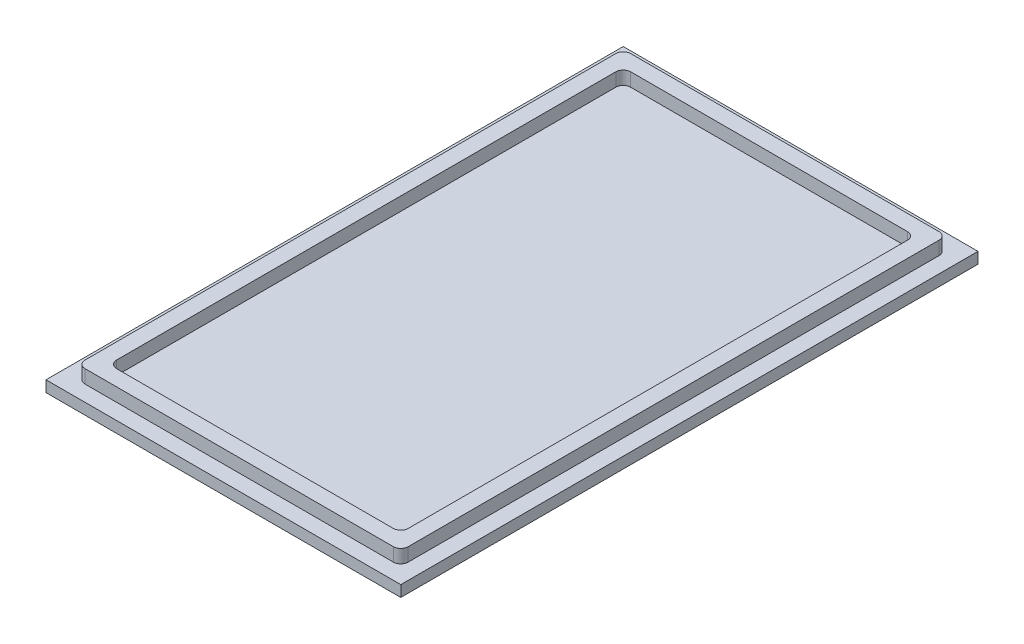
ISO-10303-21;
HEADER;
FILE_DESCRIPTION(('STEP AP214'),'2;1');
FILE_NAME('part.step','',(''),(''),'','','');
FILE_SCHEMA(('AUTOMOTIVE_DESIGN { 1 0 10303 214 1 1 1 1 }'));
ENDSEC;
DATA;
#1=APPLICATION_CONTEXT('core data for automotive mechanical design processes');
#2=APPLICATION_PROTOCOL_DEFINITION('international standard','automotive_design',2000,#1);
#3=PRODUCT_CONTEXT('',#1,'mechanical');
#4=PRODUCT('Part','Part','',(#3));
#5=PRODUCT_RELATED_PRODUCT_CATEGORY('part','',(#4));
#6=PRODUCT_DEFINITION_FORMATION('','',#4);
#7=PRODUCT_DEFINITION_CONTEXT('part definition',#1,'design');
#8=PRODUCT_DEFINITION('design','',#6,#7);
#9=PRODUCT_DEFINITION_SHAPE('','',#8);
#10=(LENGTH_UNIT() NAMED_UNIT(*) SI_UNIT(.MILLI.,.METRE.));
#11=(NAMED_UNIT(*) PLANE_ANGLE_UNIT() SI_UNIT($,.RADIAN.));
#12=(NAMED_UNIT(*) SI_UNIT($,.STERADIAN.) SOLID_ANGLE_UNIT());
#13=UNCERTAINTY_MEASURE_WITH_UNIT(LENGTH_MEASURE(1.E-05),#10,'distance_accuracy_value','');
#14=(GEOMETRIC_REPRESENTATION_CONTEXT(3) GLOBAL_UNCERTAINTY_ASSIGNED_CONTEXT((#13)) GLOBAL_UNIT_ASSIGNED_CONTEXT((#10,
#11,#12)) REPRESENTATION_CONTEXT('',''));
#15=CARTESIAN_POINT('',(0.,0.,0.));
#16=DIRECTION('',(0.,0.,1.));
#17=DIRECTION('',(1.,0.,0.));
#18=AXIS2_PLACEMENT_3D('',#15,#16,#17);
#19=CARTESIAN_POINT('',(0.203228322161903,-0.0321835084893109,0.352643796766574));
#20=DIRECTION('',(0.,1.,0.));
#21=DIRECTION('',(0.,0.,1.));
#22=AXIS2_PLACEMENT_3D('',#19,#20,#21);
#23=PLANE('',#22);
#24=DIRECTION('',(0.,0.,-1.));
#25=VECTOR('',#24,1.);
#26=CARTESIAN_POINT('',(32.2028322161904,-0.0321835084893109,0.352643796766574));
#27=LINE('',#26,#25);
#28=CARTESIAN_POINT('',(32.2028322161904,-0.0321835084893109,66.9298850382692));
#29=VERTEX_POINT('',#28);
#30=CARTESIAN_POINT('',(32.2028322161904,-0.0321835084893105,59.0098850382692));
#31=VERTEX_POINT('',#30);
#32=EDGE_CURVE('E310',#29,#31,#27,.T.);
#33=ORIENTED_EDGE('',*,*,#32,.T.);
#34=DIRECTION('',(1.,0.,0.));
#35=VECTOR('',#34,1.);
#36=CARTESIAN_POINT('',(8.44283221619036,-0.0321835084893105,59.0098850382692));
#37=LINE('',#36,#35);
#38=CARTESIAN_POINT('',(8.44283221619036,-0.0321835084893105,59.0098850382692));
#39=VERTEX_POINT('',#38);
#40=EDGE_CURVE('E297',#39,#31,#37,.T.);
#41=ORIENTED_EDGE('',*,*,#40,.F.);
#42=DIRECTION('',(0.,0.,-1.));
#43=VECTOR('',#42,1.);
#44=CARTESIAN_POINT('',(8.44283221619036,-0.0321835084893109,0.352643796766575));
#45=LINE('',#44,#43);
#46=CARTESIAN_POINT('',(8.44283221619035,-0.0321835084893109,66.9298850382692));
#47=VERTEX_POINT('',#46);
#48=EDGE_CURVE('E302',#47,#39,#45,.T.);
#49=ORIENTED_EDGE('',*,*,#48,.F.);
#50=DIRECTION('',(1.,0.,0.));
#51=VECTOR('',#50,1.);
#52=CARTESIAN_POINT('',(0.203228322161903,-0.0321835084893109,66.9298850382692));
#53=LINE('',#52,#51);
#54=EDGE_CURVE('E303',#47,#29,#53,.T.);
#55=ORIENTED_EDGE('',*,*,#54,.T.);
#56=EDGE_LOOP('',(#33,#41,#49,#55));
#57=FACE_BOUND('',#56,.T.);
#58=DIRECTION('',(0.,0.,-1.));
#59=VECTOR('',#58,1.);
#60=CARTESIAN_POINT('',(43.9426146770922,-0.0321835084893109,73.7128301516969));
#61=LINE('',#60,#59);
#62=CARTESIAN_POINT('',(43.9426146770922,-0.0321835084893109,73.7128301516969));
#63=VERTEX_POINT('',#62);
#64=CARTESIAN_POINT('',(43.9426146770922,-0.0321835084893109,-3.14753477010683));
#65=VERTEX_POINT('',#64);
#66=EDGE_CURVE('E377',#63,#65,#61,.T.);
#67=ORIENTED_EDGE('',*,*,#66,.F.);
#68=DIRECTION('',(-1.,0.,0.));
#69=VECTOR('',#68,1.);
#70=CARTESIAN_POINT('',(43.9426146770922,-0.0321835084893109,73.7128301516969));
#71=LINE('',#70,#69);
#72=CARTESIAN_POINT('',(-3.29695024471152,-0.0321835084893109,73.7128301516969));
#73=VERTEX_POINT('',#72);
#74=EDGE_CURVE('E397',#63,#73,#71,.T.);
#75=ORIENTED_EDGE('',*,*,#74,.T.);
#76=DIRECTION('',(0.,0.,-1.));
#77=VECTOR('',#76,1.);
#78=CARTESIAN_POINT('',(-3.29695024471152,-0.0321835084893109,73.7128301516969));
#79=LINE('',#78,#77);
#80=CARTESIAN_POINT('',(-3.29695024471152,-0.0321835084893109,-3.14753477010683));
#81=VERTEX_POINT('',#80);
#82=EDGE_CURVE('E416',#73,#81,#79,.T.);
#83=ORIENTED_EDGE('',*,*,#82,.T.);
#84=DIRECTION('',(-1.,0.,0.));
#85=VECTOR('',#84,1.);
#86=CARTESIAN_POINT('',(43.9426146770922,-0.0321835084893109,-3.14753477010683));
#87=LINE('',#86,#85);
#88=EDGE_CURVE('E412',#65,#81,#87,.T.);
#89=ORIENTED_EDGE('',*,*,#88,.F.);
#90=EDGE_LOOP('',(#67,#75,#83,#89));
#91=FACE_BOUND('',#90,.T.);
#92=DIRECTION('',(1.,0.,0.));
#93=VECTOR('',#92,1.);
#94=CARTESIAN_POINT('',(0.203228322161903,-0.0321835084893109,3.56988503826919));
#95=LINE('',#94,#93);
#96=CARTESIAN_POINT('',(8.44283221619036,-0.0321835084893109,3.56988503826919));
#97=VERTEX_POINT('',#96);
#98=CARTESIAN_POINT('',(32.2028322161904,-0.0321835084893109,3.56988503826919));
#99=VERTEX_POINT('',#98);
#100=EDGE_CURVE('E300',#97,#99,#95,.T.);
#101=ORIENTED_EDGE('',*,*,#100,.F.);
#102=CARTESIAN_POINT('',(8.44283221619036,-0.0321835084893113,11.4898850382692));
#103=VERTEX_POINT('',#102);
#104=EDGE_CURVE('E277',#103,#97,#45,.T.);
#105=ORIENTED_EDGE('',*,*,#104,.F.);
#106=DIRECTION('',(1.,0.,0.));
#107=VECTOR('',#106,1.);
#108=CARTESIAN_POINT('',(8.44283221619036,-0.0321835084893113,11.4898850382692));
#109=LINE('',#108,#107);
#110=CARTESIAN_POINT('',(32.2028322161904,-0.0321835084893113,11.4898850382692));
#111=VERTEX_POINT('',#110);
#112=EDGE_CURVE('E286',#103,#111,#109,.T.);
#113=ORIENTED_EDGE('',*,*,#112,.T.);
#114=EDGE_CURVE('E592',#111,#99,#27,.T.);
#115=ORIENTED_EDGE('',*,*,#114,.T.);
#116=EDGE_LOOP('',(#101,#105,#113,#115));
#117=FACE_BOUND('',#116,.T.);
#118=ADVANCED_FACE('F62',(#57,#91,#117),#23,.F.);
#119=CARTESIAN_POINT('',(0.203228322161903,1.45281649151069,0.352643796766574));
#120=DIRECTION('',(0.,1.,0.));
#121=DIRECTION('',(0.,0.,1.));
#122=AXIS2_PLACEMENT_3D('',#119,#120,#121);
#123=PLANE('',#122);
#124=DIRECTION('',(0.,0.,-1.));
#125=VECTOR('',#124,1.);
#126=CARTESIAN_POINT('',(43.9426146770922,1.45281649151069,73.7128301516969));
#127=LINE('',#126,#125);
#128=CARTESIAN_POINT('',(43.9426146770922,1.45281649151069,73.7128301516969));
#129=VERTEX_POINT('',#128);
#130=CARTESIAN_POINT('',(43.9426146770922,1.45281649151069,-3.14753477010683));
#131=VERTEX_POINT('',#130);
#132=EDGE_CURVE('E392',#129,#131,#127,.T.);
#133=ORIENTED_EDGE('',*,*,#132,.T.);
#134=DIRECTION('',(-1.,0.,0.));
#135=VECTOR('',#134,1.);
#136=CARTESIAN_POINT('',(43.9426146770922,1.45281649151069,-3.14753477010683));
#137=LINE('',#136,#135);
#138=CARTESIAN_POINT('',(-3.29695024471152,1.45281649151069,-3.14753477010683));
#139=VERTEX_POINT('',#138);
#140=EDGE_CURVE('E396',#131,#139,#137,.T.);
#141=ORIENTED_EDGE('',*,*,#140,.T.);
#142=DIRECTION('',(0.,0.,-1.));
#143=VECTOR('',#142,1.);
#144=CARTESIAN_POINT('',(-3.29695024471152,1.45281649151069,73.7128301516969));
#145=LINE('',#144,#143);
#146=CARTESIAN_POINT('',(-3.29695024471152,1.45281649151069,73.7128301516969));
#147=VERTEX_POINT('',#146);
#148=EDGE_CURVE('E400',#147,#139,#145,.T.);
#149=ORIENTED_EDGE('',*,*,#148,.F.);
#150=DIRECTION('',(-1.,0.,0.));
#151=VECTOR('',#150,1.);
#152=CARTESIAN_POINT('',(43.9426146770922,1.45281649151069,73.7128301516969));
#153=LINE('',#152,#151);
#154=EDGE_CURVE('E404',#129,#147,#153,.T.);
#155=ORIENTED_EDGE('',*,*,#154,.F.);
#156=EDGE_LOOP('',(#133,#141,#149,#155));
#157=FACE_BOUND('',#156,.T.);
#158=DIRECTION('',(1.,0.,0.));
#159=VECTOR('',#158,1.);
#160=CARTESIAN_POINT('',(-1.19684310458746,1.45281649151069,71.6127230115728));
#161=LINE('',#160,#159);
#162=CARTESIAN_POINT('',(-0.206843104587465,1.45281649151069,71.6127230115728));
#163=VERTEX_POINT('',#162);
#164=CARTESIAN_POINT('',(40.8525075369682,1.45281649151069,71.6127230115728));
#165=VERTEX_POINT('',#164);
#166=EDGE_CURVE('E381',#163,#165,#161,.T.);
#167=ORIENTED_EDGE('',*,*,#166,.F.);
#168=CARTESIAN_POINT('',(-0.206843104587465,1.45281649151069,70.6227230115728));
#169=DIRECTION('',(0.,1.,0.));
#170=DIRECTION('',(0.,0.,1.));
#171=AXIS2_PLACEMENT_3D('',#168,#169,#170);
#172=CIRCLE('',#171,0.99);
#173=CARTESIAN_POINT('',(-1.19684310458746,1.45281649151069,70.6227230115728));
#174=VERTEX_POINT('',#173);
#175=EDGE_CURVE('E518',#163,#174,#172,.F.);
#176=ORIENTED_EDGE('',*,*,#175,.T.);
#177=DIRECTION('',(0.,0.,1.));
#178=VECTOR('',#177,1.);
#179=CARTESIAN_POINT('',(-1.19684310458747,1.45281649151069,-1.04742762998278));
#180=LINE('',#179,#178);
#181=CARTESIAN_POINT('',(-1.19684310458747,1.45281649151069,-0.0574276299827787));
#182=VERTEX_POINT('',#181);
#183=EDGE_CURVE('E345',#182,#174,#180,.T.);
#184=ORIENTED_EDGE('',*,*,#183,.F.);
#185=CARTESIAN_POINT('',(-0.206843104587473,1.45281649151069,-0.0574276299827787));
#186=DIRECTION('',(0.,1.,0.));
#187=DIRECTION('',(0.,0.,1.));
#188=AXIS2_PLACEMENT_3D('',#185,#186,#187);
#189=CIRCLE('',#188,0.99);
#190=CARTESIAN_POINT('',(-0.206843104587473,1.45281649151069,-1.04742762998278));
#191=VERTEX_POINT('',#190);
#192=EDGE_CURVE('E536',#182,#191,#189,.F.);
#193=ORIENTED_EDGE('',*,*,#192,.T.);
#194=DIRECTION('',(1.,0.,0.));
#195=VECTOR('',#194,1.);
#196=CARTESIAN_POINT('',(-1.19684310458747,1.45281649151069,-1.04742762998278));
#197=LINE('',#196,#195);
#198=CARTESIAN_POINT('',(40.8525075369682,1.45281649151069,-1.04742762998278));
#199=VERTEX_POINT('',#198);
#200=EDGE_CURVE('E365',#191,#199,#197,.T.);
#201=ORIENTED_EDGE('',*,*,#200,.T.);
#202=CARTESIAN_POINT('',(40.8525075369682,1.45281649151069,-0.0574276299827787));
#203=DIRECTION('',(0.,1.,0.));
#204=DIRECTION('',(0.,0.,1.));
#205=AXIS2_PLACEMENT_3D('',#202,#203,#204);
#206=CIRCLE('',#205,0.99);
#207=CARTESIAN_POINT('',(41.8425075369682,1.45281649151069,-0.0574276299827789));
#208=VERTEX_POINT('',#207);
#209=EDGE_CURVE('E533',#199,#208,#206,.F.);
#210=ORIENTED_EDGE('',*,*,#209,.T.);
#211=DIRECTION('',(0.,0.,1.));
#212=VECTOR('',#211,1.);
#213=CARTESIAN_POINT('',(41.8425075369682,1.45281649151069,-1.04742762998278));
#214=LINE('',#213,#212);
#215=CARTESIAN_POINT('',(41.8425075369682,1.45281649151069,70.6227230115728));
#216=VERTEX_POINT('',#215);
#217=EDGE_CURVE('E385',#208,#216,#214,.T.);
#218=ORIENTED_EDGE('',*,*,#217,.T.);
#219=CARTESIAN_POINT('',(40.8525075369682,1.45281649151069,70.6227230115728));
#220=DIRECTION('',(0.,1.,0.));
#221=DIRECTION('',(0.,0.,1.));
#222=AXIS2_PLACEMENT_3D('',#219,#220,#221);
#223=CIRCLE('',#222,0.99);
#224=EDGE_CURVE('E524',#216,#165,#223,.F.);
#225=ORIENTED_EDGE('',*,*,#224,.T.);
#226=EDGE_LOOP('',(#167,#176,#184,#193,#201,#210,#218,#225));
#227=FACE_BOUND('',#226,.T.);
#228=ADVANCED_FACE('F653',(#157,#227),#123,.T.);
#229=CARTESIAN_POINT('',(43.9426146770922,1.45281649151069,73.7128301516969));
#230=DIRECTION('',(-1.,0.,0.));
#231=DIRECTION('',(0.,0.,1.));
#232=AXIS2_PLACEMENT_3D('',#229,#230,#231);
#233=PLANE('',#232);
#234=ORIENTED_EDGE('',*,*,#66,.T.);
#235=DIRECTION('',(0.,-1.,0.));
#236=VECTOR('',#235,1.);
#237=CARTESIAN_POINT('',(43.9426146770922,1.45281649151069,-3.14753477010683));
#238=LINE('',#237,#236);
#239=EDGE_CURVE('E431',#131,#65,#238,.T.);
#240=ORIENTED_EDGE('',*,*,#239,.F.);
#241=ORIENTED_EDGE('',*,*,#132,.F.);
#242=DIRECTION('',(0.,-1.,0.));
#243=VECTOR('',#242,1.);
#244=CARTESIAN_POINT('',(43.9426146770922,1.45281649151069,73.7128301516969));
#245=LINE('',#244,#243);
#246=EDGE_CURVE('E408',#129,#63,#245,.T.);
#247=ORIENTED_EDGE('',*,*,#246,.T.);
#248=EDGE_LOOP('',(#234,#240,#241,#247));
#249=FACE_BOUND('',#248,.T.);
#250=ADVANCED_FACE('F658',(#249),#233,.F.);
#251=CARTESIAN_POINT('',(43.9426146770922,1.45281649151069,-3.14753477010683));
#252=DIRECTION('',(0.,0.,1.));
#253=DIRECTION('',(1.,0.,0.));
#254=AXIS2_PLACEMENT_3D('',#251,#252,#253);
#255=PLANE('',#254);
#256=ORIENTED_EDGE('',*,*,#88,.T.);
#257=DIRECTION('',(0.,-1.,0.));
#258=VECTOR('',#257,1.);
#259=CARTESIAN_POINT('',(-3.29695024471152,1.45281649151069,-3.14753477010683));
#260=LINE('',#259,#258);
#261=EDGE_CURVE('E428',#139,#81,#260,.T.);
#262=ORIENTED_EDGE('',*,*,#261,.F.);
#263=ORIENTED_EDGE('',*,*,#140,.F.);
#264=ORIENTED_EDGE('',*,*,#239,.T.);
#265=EDGE_LOOP('',(#256,#262,#263,#264));
#266=FACE_BOUND('',#265,.T.);
#267=ADVANCED_FACE('F672',(#266),#255,.F.);
#268=CARTESIAN_POINT('',(-3.29695024471152,1.45281649151069,73.7128301516969));
#269=DIRECTION('',(-1.,0.,0.));
#270=DIRECTION('',(0.,0.,1.));
#271=AXIS2_PLACEMENT_3D('',#268,#269,#270);
#272=PLANE('',#271);
#273=ORIENTED_EDGE('',*,*,#82,.F.);
#274=DIRECTION('',(0.,-1.,0.));
#275=VECTOR('',#274,1.);
#276=CARTESIAN_POINT('',(-3.29695024471152,1.45281649151069,73.7128301516969));
#277=LINE('',#276,#275);
#278=EDGE_CURVE('E425',#147,#73,#277,.T.);
#279=ORIENTED_EDGE('',*,*,#278,.F.);
#280=ORIENTED_EDGE('',*,*,#148,.T.);
#281=ORIENTED_EDGE('',*,*,#261,.T.);
#282=EDGE_LOOP('',(#273,#279,#280,#281));
#283=FACE_BOUND('',#282,.T.);
#284=ADVANCED_FACE('F668',(#283),#272,.T.);
#285=CARTESIAN_POINT('',(43.9426146770922,1.45281649151069,73.7128301516969));
#286=DIRECTION('',(0.,0.,1.));
#287=DIRECTION('',(1.,0.,0.));
#288=AXIS2_PLACEMENT_3D('',#285,#286,#287);
#289=PLANE('',#288);
#290=ORIENTED_EDGE('',*,*,#74,.F.);
#291=ORIENTED_EDGE('',*,*,#246,.F.);
#292=ORIENTED_EDGE('',*,*,#154,.T.);
#293=ORIENTED_EDGE('',*,*,#278,.T.);
#294=EDGE_LOOP('',(#290,#291,#292,#293));
#295=FACE_BOUND('',#294,.T.);
#296=ADVANCED_FACE('F664',(#295),#289,.T.);
#297=CARTESIAN_POINT('',(-1.19684310458747,3.23481649151069,-1.04742762998278));
#298=DIRECTION('',(1.,0.,0.));
#299=DIRECTION('',(0.,0.,-1.));
#300=AXIS2_PLACEMENT_3D('',#297,#298,#299);
#301=PLANE('',#300);
#302=ORIENTED_EDGE('',*,*,#183,.T.);
#303=DIRECTION('',(0.,-1.,0.));
#304=VECTOR('',#303,1.);
#305=CARTESIAN_POINT('',(-1.19684310458746,3.23481649151069,70.6227230115728));
#306=LINE('',#305,#304);
#307=CARTESIAN_POINT('',(-1.19684310458746,3.23481649151069,70.6227230115728));
#308=VERTEX_POINT('',#307);
#309=EDGE_CURVE('E472',#174,#308,#306,.F.);
#310=ORIENTED_EDGE('',*,*,#309,.T.);
#311=DIRECTION('',(0.,0.,1.));
#312=VECTOR('',#311,1.);
#313=CARTESIAN_POINT('',(-1.19684310458747,3.23481649151069,-1.04742762998278));
#314=LINE('',#313,#312);
#315=CARTESIAN_POINT('',(-1.19684310458747,3.23481649151069,-0.0574276299827787));
#316=VERTEX_POINT('',#315);
#317=EDGE_CURVE('E360',#316,#308,#314,.T.);
#318=ORIENTED_EDGE('',*,*,#317,.F.);
#319=DIRECTION('',(0.,-1.,0.));
#320=VECTOR('',#319,1.);
#321=CARTESIAN_POINT('',(-1.19684310458747,1.45281649151069,-0.0574276299827786));
#322=LINE('',#321,#320);
#323=EDGE_CURVE('E468',#316,#182,#322,.T.);
#324=ORIENTED_EDGE('',*,*,#323,.T.);
#325=EDGE_LOOP('',(#302,#310,#318,#324));
#326=FACE_BOUND('',#325,.T.);
#327=ADVANCED_FACE('F667',(#326),#301,.F.);
#328=CARTESIAN_POINT('',(-1.19684310458746,3.23481649151069,71.6127230115728));
#329=DIRECTION('',(0.,0.,-1.));
#330=DIRECTION('',(-1.,0.,0.));
#331=AXIS2_PLACEMENT_3D('',#328,#329,#330);
#332=PLANE('',#331);
#333=DIRECTION('',(1.,0.,0.));
#334=VECTOR('',#333,1.);
#335=CARTESIAN_POINT('',(-1.19684310458746,3.23481649151069,71.6127230115728));
#336=LINE('',#335,#334);
#337=CARTESIAN_POINT('',(-0.206843104587465,3.23481649151069,71.6127230115728));
#338=VERTEX_POINT('',#337);
#339=CARTESIAN_POINT('',(40.8525075369682,3.23481649151069,71.6127230115728));
#340=VERTEX_POINT('',#339);
#341=EDGE_CURVE('E364',#338,#340,#336,.T.);
#342=ORIENTED_EDGE('',*,*,#341,.F.);
#343=DIRECTION('',(0.,-1.,0.));
#344=VECTOR('',#343,1.);
#345=CARTESIAN_POINT('',(-0.206843104587465,3.23481649151069,71.6127230115728));
#346=LINE('',#345,#344);
#347=EDGE_CURVE('E464',#338,#163,#346,.T.);
#348=ORIENTED_EDGE('',*,*,#347,.T.);
#349=ORIENTED_EDGE('',*,*,#166,.T.);
#350=DIRECTION('',(0.,-1.,0.));
#351=VECTOR('',#350,1.);
#352=CARTESIAN_POINT('',(40.8525075369682,3.23481649151069,71.6127230115728));
#353=LINE('',#352,#351);
#354=EDGE_CURVE('E461',#165,#340,#353,.F.);
#355=ORIENTED_EDGE('',*,*,#354,.T.);
#356=EDGE_LOOP('',(#342,#348,#349,#355));
#357=FACE_BOUND('',#356,.T.);
#358=ADVANCED_FACE('F964',(#357),#332,.F.);
#359=CARTESIAN_POINT('',(41.8425075369682,3.23481649151069,-1.04742762998278));
#360=DIRECTION('',(1.,0.,0.));
#361=DIRECTION('',(0.,0.,-1.));
#362=AXIS2_PLACEMENT_3D('',#359,#360,#361);
#363=PLANE('',#362);
#364=DIRECTION('',(0.,0.,1.));
#365=VECTOR('',#364,1.);
#366=CARTESIAN_POINT('',(41.8425075369682,3.23481649151069,-1.04742762998278));
#367=LINE('',#366,#365);
#368=CARTESIAN_POINT('',(41.8425075369682,3.23481649151069,-0.0574276299827789));
#369=VERTEX_POINT('',#368);
#370=CARTESIAN_POINT('',(41.8425075369682,3.23481649151069,70.6227230115728));
#371=VERTEX_POINT('',#370);
#372=EDGE_CURVE('E369',#369,#371,#367,.T.);
#373=ORIENTED_EDGE('',*,*,#372,.T.);
#374=DIRECTION('',(0.,-1.,0.));
#375=VECTOR('',#374,1.);
#376=CARTESIAN_POINT('',(41.8425075369682,1.45281649151069,70.6227230115728));
#377=LINE('',#376,#375);
#378=EDGE_CURVE('E497',#371,#216,#377,.T.);
#379=ORIENTED_EDGE('',*,*,#378,.T.);
#380=ORIENTED_EDGE('',*,*,#217,.F.);
#381=DIRECTION('',(0.,-1.,0.));
#382=VECTOR('',#381,1.);
#383=CARTESIAN_POINT('',(41.8425075369682,3.23481649151069,-0.0574276299827789));
#384=LINE('',#383,#382);
#385=EDGE_CURVE('E494',#208,#369,#384,.F.);
#386=ORIENTED_EDGE('',*,*,#385,.T.);
#387=EDGE_LOOP('',(#373,#379,#380,#386));
#388=FACE_BOUND('',#387,.T.);
#389=ADVANCED_FACE('F954',(#388),#363,.T.);
#390=CARTESIAN_POINT('',(-1.19684310458747,3.23481649151069,-1.04742762998278));
#391=DIRECTION('',(0.,0.,-1.));
#392=DIRECTION('',(-1.,0.,0.));
#393=AXIS2_PLACEMENT_3D('',#390,#391,#392);
#394=PLANE('',#393);
#395=DIRECTION('',(1.,0.,0.));
#396=VECTOR('',#395,1.);
#397=CARTESIAN_POINT('',(-1.19684310458747,3.23481649151069,-1.04742762998278));
#398=LINE('',#397,#396);
#399=CARTESIAN_POINT('',(-0.206843104587473,3.23481649151069,-1.04742762998278));
#400=VERTEX_POINT('',#399);
#401=CARTESIAN_POINT('',(40.8525075369682,3.23481649151069,-1.04742762998278));
#402=VERTEX_POINT('',#401);
#403=EDGE_CURVE('E373',#400,#402,#398,.T.);
#404=ORIENTED_EDGE('',*,*,#403,.T.);
#405=DIRECTION('',(0.,-1.,0.));
#406=VECTOR('',#405,1.);
#407=CARTESIAN_POINT('',(40.8525075369682,3.23481649151069,-1.04742762998278));
#408=LINE('',#407,#406);
#409=EDGE_CURVE('E511',#402,#199,#408,.T.);
#410=ORIENTED_EDGE('',*,*,#409,.T.);
#411=ORIENTED_EDGE('',*,*,#200,.F.);
#412=DIRECTION('',(0.,-1.,0.));
#413=VECTOR('',#412,1.);
#414=CARTESIAN_POINT('',(-0.206843104587473,3.23481649151069,-1.04742762998278));
#415=LINE('',#414,#413);
#416=EDGE_CURVE('E508',#191,#400,#415,.F.);
#417=ORIENTED_EDGE('',*,*,#416,.T.);
#418=EDGE_LOOP('',(#404,#410,#411,#417));
#419=FACE_BOUND('',#418,.T.);
#420=ADVANCED_FACE('F944',(#419),#394,.T.);
#421=CARTESIAN_POINT('',(0.203228322161903,3.23481649151069,0.352643796766574));
#422=DIRECTION('',(0.,1.,0.));
#423=DIRECTION('',(0.,0.,1.));
#424=AXIS2_PLACEMENT_3D('',#421,#422,#423);
#425=PLANE('',#424);
#426=DIRECTION('',(0.,0.,1.));
#427=VECTOR('',#426,1.);
#428=CARTESIAN_POINT('',(0.903264035536573,3.23481649151069,1.05267951014127));
#429=LINE('',#428,#427);
#430=CARTESIAN_POINT('',(0.903264035536573,3.23481649151069,2.04267951014127));
#431=VERTEX_POINT('',#430);
#432=CARTESIAN_POINT('',(0.903264035536573,3.23481649151069,68.5226158714488));
#433=VERTEX_POINT('',#432);
#434=EDGE_CURVE('E341',#431,#433,#429,.T.);
#435=ORIENTED_EDGE('',*,*,#434,.F.);
#436=CARTESIAN_POINT('',(1.89326403553657,3.23481649151069,2.04267951014127));
#437=DIRECTION('',(0.,1.,0.));
#438=DIRECTION('',(0.,0.,1.));
#439=AXIS2_PLACEMENT_3D('',#436,#437,#438);
#440=CIRCLE('',#439,0.99);
#441=CARTESIAN_POINT('',(1.89326403553657,3.23481649151069,1.05267951014127));
#442=VERTEX_POINT('',#441);
#443=EDGE_CURVE('E527',#431,#442,#440,.F.);
#444=ORIENTED_EDGE('',*,*,#443,.T.);
#445=DIRECTION('',(1.,0.,0.));
#446=VECTOR('',#445,1.);
#447=CARTESIAN_POINT('',(0.903264035536573,3.23481649151069,1.05267951014127));
#448=LINE('',#447,#446);
#449=CARTESIAN_POINT('',(38.7524003968441,3.23481649151069,1.05267951014127));
#450=VERTEX_POINT('',#449);
#451=EDGE_CURVE('E328',#442,#450,#448,.T.);
#452=ORIENTED_EDGE('',*,*,#451,.T.);
#453=CARTESIAN_POINT('',(38.7524003968441,3.23481649151069,2.04267951014127));
#454=DIRECTION('',(0.,1.,0.));
#455=DIRECTION('',(0.,0.,1.));
#456=AXIS2_PLACEMENT_3D('',#453,#454,#455);
#457=CIRCLE('',#456,0.99);
#458=CARTESIAN_POINT('',(39.7424003968441,3.23481649151069,2.04267951014127));
#459=VERTEX_POINT('',#458);
#460=EDGE_CURVE('E530',#450,#459,#457,.F.);
#461=ORIENTED_EDGE('',*,*,#460,.T.);
#462=DIRECTION('',(0.,0.,1.));
#463=VECTOR('',#462,1.);
#464=CARTESIAN_POINT('',(39.7424003968441,3.23481649151069,1.05267951014127));
#465=LINE('',#464,#463);
#466=CARTESIAN_POINT('',(39.7424003968441,3.23481649151069,68.5226158714488));
#467=VERTEX_POINT('',#466);
#468=EDGE_CURVE('E332',#459,#467,#465,.T.);
#469=ORIENTED_EDGE('',*,*,#468,.T.);
#470=CARTESIAN_POINT('',(38.7524003968441,3.23481649151069,68.5226158714488));
#471=DIRECTION('',(0.,1.,0.));
#472=DIRECTION('',(0.,0.,1.));
#473=AXIS2_PLACEMENT_3D('',#470,#471,#472);
#474=CIRCLE('',#473,0.99);
#475=CARTESIAN_POINT('',(38.7524003968441,3.23481649151069,69.5126158714488));
#476=VERTEX_POINT('',#475);
#477=EDGE_CURVE('E521',#467,#476,#474,.F.);
#478=ORIENTED_EDGE('',*,*,#477,.T.);
#479=DIRECTION('',(1.,0.,0.));
#480=VECTOR('',#479,1.);
#481=CARTESIAN_POINT('',(0.903264035536573,3.23481649151069,69.5126158714488));
#482=LINE('',#481,#480);
#483=CARTESIAN_POINT('',(1.89326403553657,3.23481649151069,69.5126158714488));
#484=VERTEX_POINT('',#483);
#485=EDGE_CURVE('E337',#484,#476,#482,.T.);
#486=ORIENTED_EDGE('',*,*,#485,.F.);
#487=CARTESIAN_POINT('',(1.89326403553657,3.23481649151069,68.5226158714488));
#488=DIRECTION('',(0.,1.,0.));
#489=DIRECTION('',(0.,0.,1.));
#490=AXIS2_PLACEMENT_3D('',#487,#488,#489);
#491=CIRCLE('',#490,0.99);
#492=EDGE_CURVE('E515',#484,#433,#491,.F.);
#493=ORIENTED_EDGE('',*,*,#492,.T.);
#494=EDGE_LOOP('',(#435,#444,#452,#461,#469,#478,#486,#493));
#495=FACE_BOUND('',#494,.T.);
#496=ORIENTED_EDGE('',*,*,#317,.T.);
#497=CARTESIAN_POINT('',(-0.206843104587465,3.23481649151069,70.6227230115728));
#498=DIRECTION('',(0.,1.,0.));
#499=DIRECTION('',(0.,0.,1.));
#500=AXIS2_PLACEMENT_3D('',#497,#498,#499);
#501=CIRCLE('',#500,0.99);
#502=EDGE_CURVE('E484',#308,#338,#501,.T.);
#503=ORIENTED_EDGE('',*,*,#502,.T.);
#504=ORIENTED_EDGE('',*,*,#341,.T.);
#505=CARTESIAN_POINT('',(40.8525075369682,3.23481649151069,70.6227230115728));
#506=DIRECTION('',(0.,1.,0.));
#507=DIRECTION('',(0.,0.,1.));
#508=AXIS2_PLACEMENT_3D('',#505,#506,#507);
#509=CIRCLE('',#508,0.99);
#510=EDGE_CURVE('E481',#340,#371,#509,.T.);
#511=ORIENTED_EDGE('',*,*,#510,.T.);
#512=ORIENTED_EDGE('',*,*,#372,.F.);
#513=CARTESIAN_POINT('',(40.8525075369682,3.23481649151069,-0.0574276299827787));
#514=DIRECTION('',(0.,1.,0.));
#515=DIRECTION('',(0.,0.,1.));
#516=AXIS2_PLACEMENT_3D('',#513,#514,#515);
#517=CIRCLE('',#516,0.99);
#518=EDGE_CURVE('E478',#369,#402,#517,.T.);
#519=ORIENTED_EDGE('',*,*,#518,.T.);
#520=ORIENTED_EDGE('',*,*,#403,.F.);
#521=CARTESIAN_POINT('',(-0.206843104587473,3.23481649151069,-0.0574276299827787));
#522=DIRECTION('',(0.,1.,0.));
#523=DIRECTION('',(0.,0.,1.));
#524=AXIS2_PLACEMENT_3D('',#521,#522,#523);
#525=CIRCLE('',#524,0.99);
#526=EDGE_CURVE('E475',#400,#316,#525,.T.);
#527=ORIENTED_EDGE('',*,*,#526,.T.);
#528=EDGE_LOOP('',(#496,#503,#504,#511,#512,#519,#520,#527));
#529=FACE_BOUND('',#528,.T.);
#530=ADVANCED_FACE('F934',(#495,#529),#425,.T.);
#531=CARTESIAN_POINT('',(0.903264035536573,3.23481649151069,1.05267951014127));
#532=DIRECTION('',(0.,0.,-1.));
#533=DIRECTION('',(-1.,0.,0.));
#534=AXIS2_PLACEMENT_3D('',#531,#532,#533);
#535=PLANE('',#534);
#536=ORIENTED_EDGE('',*,*,#451,.F.);
#537=DIRECTION('',(0.,-1.,0.));
#538=VECTOR('',#537,1.);
#539=CARTESIAN_POINT('',(1.89326403553657,3.23481649151069,1.05267951014127));
#540=LINE('',#539,#538);
#541=CARTESIAN_POINT('',(1.89326403553657,1.45281649151069,1.05267951014127));
#542=VERTEX_POINT('',#541);
#543=EDGE_CURVE('E504',#442,#542,#540,.T.);
#544=ORIENTED_EDGE('',*,*,#543,.T.);
#545=DIRECTION('',(1.,0.,0.));
#546=VECTOR('',#545,1.);
#547=CARTESIAN_POINT('',(0.903264035536573,1.45281649151069,1.05267951014127));
#548=LINE('',#547,#546);
#549=CARTESIAN_POINT('',(38.7524003968441,1.45281649151069,1.05267951014127));
#550=VERTEX_POINT('',#549);
#551=EDGE_CURVE('E327',#542,#550,#548,.T.);
#552=ORIENTED_EDGE('',*,*,#551,.T.);
#553=DIRECTION('',(0.,-1.,0.));
#554=VECTOR('',#553,1.);
#555=CARTESIAN_POINT('',(38.7524003968441,3.23481649151069,1.05267951014127));
#556=LINE('',#555,#554);
#557=EDGE_CURVE('E501',#550,#450,#556,.F.);
#558=ORIENTED_EDGE('',*,*,#557,.T.);
#559=EDGE_LOOP('',(#536,#544,#552,#558));
#560=FACE_BOUND('',#559,.T.);
#561=ADVANCED_FACE('F905',(#560),#535,.F.);
#562=CARTESIAN_POINT('',(0.903264035536573,3.23481649151069,1.05267951014127));
#563=DIRECTION('',(1.,0.,0.));
#564=DIRECTION('',(0.,0.,-1.));
#565=AXIS2_PLACEMENT_3D('',#562,#563,#564);
#566=PLANE('',#565);
#567=ORIENTED_EDGE('',*,*,#434,.T.);
#568=DIRECTION('',(0.,-1.,0.));
#569=VECTOR('',#568,1.);
#570=CARTESIAN_POINT('',(0.903264035536573,1.45281649151069,68.5226158714488));
#571=LINE('',#570,#569);
#572=CARTESIAN_POINT('',(0.903264035536573,1.45281649151069,68.5226158714488));
#573=VERTEX_POINT('',#572);
#574=EDGE_CURVE('E438',#433,#573,#571,.T.);
#575=ORIENTED_EDGE('',*,*,#574,.T.);
#576=DIRECTION('',(0.,0.,1.));
#577=VECTOR('',#576,1.);
#578=CARTESIAN_POINT('',(0.903264035536573,1.45281649151069,1.05267951014127));
#579=LINE('',#578,#577);
#580=CARTESIAN_POINT('',(0.903264035536573,1.45281649151069,2.04267951014127));
#581=VERTEX_POINT('',#580);
#582=EDGE_CURVE('E333',#581,#573,#579,.T.);
#583=ORIENTED_EDGE('',*,*,#582,.F.);
#584=DIRECTION('',(0.,-1.,0.));
#585=VECTOR('',#584,1.);
#586=CARTESIAN_POINT('',(0.903264035536573,3.23481649151069,2.04267951014127));
#587=LINE('',#586,#585);
#588=EDGE_CURVE('E435',#581,#431,#587,.F.);
#589=ORIENTED_EDGE('',*,*,#588,.T.);
#590=EDGE_LOOP('',(#567,#575,#583,#589));
#591=FACE_BOUND('',#590,.T.);
#592=ADVANCED_FACE('F898',(#591),#566,.T.);
#593=CARTESIAN_POINT('',(0.903264035536573,3.23481649151069,69.5126158714488));
#594=DIRECTION('',(0.,0.,-1.));
#595=DIRECTION('',(-1.,0.,0.));
#596=AXIS2_PLACEMENT_3D('',#593,#594,#595);
#597=PLANE('',#596);
#598=DIRECTION('',(1.,0.,0.));
#599=VECTOR('',#598,1.);
#600=CARTESIAN_POINT('',(0.903264035536573,1.45281649151069,69.5126158714488));
#601=LINE('',#600,#599);
#602=CARTESIAN_POINT('',(1.89326403553657,1.45281649151069,69.5126158714488));
#603=VERTEX_POINT('',#602);
#604=CARTESIAN_POINT('',(38.7524003968441,1.45281649151069,69.5126158714488));
#605=VERTEX_POINT('',#604);
#606=EDGE_CURVE('E353',#603,#605,#601,.T.);
#607=ORIENTED_EDGE('',*,*,#606,.F.);
#608=DIRECTION('',(0.,-1.,0.));
#609=VECTOR('',#608,1.);
#610=CARTESIAN_POINT('',(1.89326403553657,3.23481649151069,69.5126158714488));
#611=LINE('',#610,#609);
#612=EDGE_CURVE('E458',#603,#484,#611,.F.);
#613=ORIENTED_EDGE('',*,*,#612,.T.);
#614=ORIENTED_EDGE('',*,*,#485,.T.);
#615=DIRECTION('',(0.,-1.,0.));
#616=VECTOR('',#615,1.);
#617=CARTESIAN_POINT('',(38.7524003968441,3.23481649151069,69.5126158714488));
#618=LINE('',#617,#616);
#619=EDGE_CURVE('E454',#476,#605,#618,.T.);
#620=ORIENTED_EDGE('',*,*,#619,.T.);
#621=EDGE_LOOP('',(#607,#613,#614,#620));
#622=FACE_BOUND('',#621,.T.);
#623=ADVANCED_FACE('F904',(#622),#597,.T.);
#624=CARTESIAN_POINT('',(39.7424003968441,3.23481649151069,1.05267951014127));
#625=DIRECTION('',(1.,0.,0.));
#626=DIRECTION('',(0.,0.,-1.));
#627=AXIS2_PLACEMENT_3D('',#624,#625,#626);
#628=PLANE('',#627);
#629=DIRECTION('',(0.,0.,1.));
#630=VECTOR('',#629,1.);
#631=CARTESIAN_POINT('',(39.7424003968441,1.45281649151069,1.05267951014127));
#632=LINE('',#631,#630);
#633=CARTESIAN_POINT('',(39.7424003968441,1.45281649151069,2.04267951014127));
#634=VERTEX_POINT('',#633);
#635=CARTESIAN_POINT('',(39.7424003968441,1.45281649151069,68.5226158714488));
#636=VERTEX_POINT('',#635);
#637=EDGE_CURVE('E349',#634,#636,#632,.T.);
#638=ORIENTED_EDGE('',*,*,#637,.T.);
#639=DIRECTION('',(0.,-1.,0.));
#640=VECTOR('',#639,1.);
#641=CARTESIAN_POINT('',(39.7424003968441,3.23481649151069,68.5226158714488));
#642=LINE('',#641,#640);
#643=EDGE_CURVE('E491',#636,#467,#642,.F.);
#644=ORIENTED_EDGE('',*,*,#643,.T.);
#645=ORIENTED_EDGE('',*,*,#468,.F.);
#646=DIRECTION('',(0.,-1.,0.));
#647=VECTOR('',#646,1.);
#648=CARTESIAN_POINT('',(39.7424003968441,1.45281649151069,2.04267951014127));
#649=LINE('',#648,#647);
#650=EDGE_CURVE('E487',#459,#634,#649,.T.);
#651=ORIENTED_EDGE('',*,*,#650,.T.);
#652=EDGE_LOOP('',(#638,#644,#645,#651));
#653=FACE_BOUND('',#652,.T.);
#654=ADVANCED_FACE('F917',(#653),#628,.F.);
#655=ORIENTED_EDGE('',*,*,#582,.T.);
#656=CARTESIAN_POINT('',(1.89326403553657,1.45281649151069,68.5226158714488));
#657=DIRECTION('',(0.,1.,0.));
#658=DIRECTION('',(0.,0.,1.));
#659=AXIS2_PLACEMENT_3D('',#656,#657,#658);
#660=CIRCLE('',#659,0.99);
#661=EDGE_CURVE('E451',#573,#603,#660,.T.);
#662=ORIENTED_EDGE('',*,*,#661,.T.);
#663=ORIENTED_EDGE('',*,*,#606,.T.);
#664=CARTESIAN_POINT('',(38.7524003968441,1.45281649151069,68.5226158714488));
#665=DIRECTION('',(0.,1.,0.));
#666=DIRECTION('',(0.,0.,1.));
#667=AXIS2_PLACEMENT_3D('',#664,#665,#666);
#668=CIRCLE('',#667,0.99);
#669=EDGE_CURVE('E448',#605,#636,#668,.T.);
#670=ORIENTED_EDGE('',*,*,#669,.T.);
#671=ORIENTED_EDGE('',*,*,#637,.F.);
#672=CARTESIAN_POINT('',(38.7524003968441,1.45281649151069,2.04267951014127));
#673=DIRECTION('',(0.,1.,0.));
#674=DIRECTION('',(0.,0.,1.));
#675=AXIS2_PLACEMENT_3D('',#672,#673,#674);
#676=CIRCLE('',#675,0.99);
#677=EDGE_CURVE('E442',#634,#550,#676,.T.);
#678=ORIENTED_EDGE('',*,*,#677,.T.);
#679=ORIENTED_EDGE('',*,*,#551,.F.);
#680=CARTESIAN_POINT('',(1.89326403553657,1.45281649151069,2.04267951014127));
#681=DIRECTION('',(0.,1.,0.));
#682=DIRECTION('',(0.,0.,1.));
#683=AXIS2_PLACEMENT_3D('',#680,#681,#682);
#684=CIRCLE('',#683,0.99);
#685=EDGE_CURVE('E445',#542,#581,#684,.T.);
#686=ORIENTED_EDGE('',*,*,#685,.T.);
#687=EDGE_LOOP('',(#655,#662,#663,#670,#671,#678,#679,#686));
#688=FACE_BOUND('',#687,.T.);
#689=ADVANCED_FACE('F661',(#688),#123,.T.);
#690=CARTESIAN_POINT('',(1.89326403553657,3.23481649151069,68.5226158714488));
#691=DIRECTION('',(0.,1.,0.));
#692=DIRECTION('',(0.,0.,1.));
#693=AXIS2_PLACEMENT_3D('',#690,#691,#692);
#694=CYLINDRICAL_SURFACE('',#693,0.99);
#695=ORIENTED_EDGE('',*,*,#492,.F.);
#696=ORIENTED_EDGE('',*,*,#612,.F.);
#697=ORIENTED_EDGE('',*,*,#661,.F.);
#698=ORIENTED_EDGE('',*,*,#574,.F.);
#699=EDGE_LOOP('',(#695,#696,#697,#698));
#700=FACE_BOUND('',#699,.T.);
#701=ADVANCED_FACE('F680',(#700),#694,.F.);
#702=CARTESIAN_POINT('',(-0.206843104587465,3.23481649151069,70.6227230115728));
#703=DIRECTION('',(0.,-1.,0.));
#704=DIRECTION('',(0.,0.,-1.));
#705=AXIS2_PLACEMENT_3D('',#702,#703,#704);
#706=CYLINDRICAL_SURFACE('',#705,0.99);
#707=ORIENTED_EDGE('',*,*,#502,.F.);
#708=ORIENTED_EDGE('',*,*,#309,.F.);
#709=ORIENTED_EDGE('',*,*,#175,.F.);
#710=ORIENTED_EDGE('',*,*,#347,.F.);
#711=EDGE_LOOP('',(#707,#708,#709,#710));
#712=FACE_BOUND('',#711,.T.);
#713=ADVANCED_FACE('F683',(#712),#706,.T.);
#714=CARTESIAN_POINT('',(38.7524003968441,3.23481649151069,68.5226158714488));
#715=DIRECTION('',(0.,-1.,0.));
#716=DIRECTION('',(0.,0.,-1.));
#717=AXIS2_PLACEMENT_3D('',#714,#715,#716);
#718=CYLINDRICAL_SURFACE('',#717,0.99);
#719=ORIENTED_EDGE('',*,*,#477,.F.);
#720=ORIENTED_EDGE('',*,*,#643,.F.);
#721=ORIENTED_EDGE('',*,*,#669,.F.);
#722=ORIENTED_EDGE('',*,*,#619,.F.);
#723=EDGE_LOOP('',(#719,#720,#721,#722));
#724=FACE_BOUND('',#723,.T.);
#725=ADVANCED_FACE('F687',(#724),#718,.F.);
#726=CARTESIAN_POINT('',(40.8525075369682,3.23481649151069,70.6227230115728));
#727=DIRECTION('',(0.,1.,0.));
#728=DIRECTION('',(0.,0.,1.));
#729=AXIS2_PLACEMENT_3D('',#726,#727,#728);
#730=CYLINDRICAL_SURFACE('',#729,0.99);
#731=ORIENTED_EDGE('',*,*,#510,.F.);
#732=ORIENTED_EDGE('',*,*,#354,.F.);
#733=ORIENTED_EDGE('',*,*,#224,.F.);
#734=ORIENTED_EDGE('',*,*,#378,.F.);
#735=EDGE_LOOP('',(#731,#732,#733,#734));
#736=FACE_BOUND('',#735,.T.);
#737=ADVANCED_FACE('F691',(#736),#730,.T.);
#738=CARTESIAN_POINT('',(1.89326403553657,3.23481649151069,2.04267951014127));
#739=DIRECTION('',(0.,-1.,0.));
#740=DIRECTION('',(0.,0.,-1.));
#741=AXIS2_PLACEMENT_3D('',#738,#739,#740);
#742=CYLINDRICAL_SURFACE('',#741,0.99);
#743=ORIENTED_EDGE('',*,*,#443,.F.);
#744=ORIENTED_EDGE('',*,*,#588,.F.);
#745=ORIENTED_EDGE('',*,*,#685,.F.);
#746=ORIENTED_EDGE('',*,*,#543,.F.);
#747=EDGE_LOOP('',(#743,#744,#745,#746));
#748=FACE_BOUND('',#747,.T.);
#749=ADVANCED_FACE('F695',(#748),#742,.F.);
#750=CARTESIAN_POINT('',(38.7524003968441,3.23481649151069,2.04267951014127));
#751=DIRECTION('',(0.,1.,0.));
#752=DIRECTION('',(0.,0.,1.));
#753=AXIS2_PLACEMENT_3D('',#750,#751,#752);
#754=CYLINDRICAL_SURFACE('',#753,0.99);
#755=ORIENTED_EDGE('',*,*,#460,.F.);
#756=ORIENTED_EDGE('',*,*,#557,.F.);
#757=ORIENTED_EDGE('',*,*,#677,.F.);
#758=ORIENTED_EDGE('',*,*,#650,.F.);
#759=EDGE_LOOP('',(#755,#756,#757,#758));
#760=FACE_BOUND('',#759,.T.);
#761=ADVANCED_FACE('F699',(#760),#754,.F.);
#762=CARTESIAN_POINT('',(40.8525075369682,3.23481649151069,-0.0574276299827787));
#763=DIRECTION('',(0.,-1.,0.));
#764=DIRECTION('',(0.,0.,-1.));
#765=AXIS2_PLACEMENT_3D('',#762,#763,#764);
#766=CYLINDRICAL_SURFACE('',#765,0.99);
#767=ORIENTED_EDGE('',*,*,#518,.F.);
#768=ORIENTED_EDGE('',*,*,#385,.F.);
#769=ORIENTED_EDGE('',*,*,#209,.F.);
#770=ORIENTED_EDGE('',*,*,#409,.F.);
#771=EDGE_LOOP('',(#767,#768,#769,#770));
#772=FACE_BOUND('',#771,.T.);
#773=ADVANCED_FACE('F703',(#772),#766,.T.);
#774=CARTESIAN_POINT('',(-0.206843104587473,3.23481649151069,-0.0574276299827787));
#775=DIRECTION('',(0.,1.,0.));
#776=DIRECTION('',(0.,0.,1.));
#777=AXIS2_PLACEMENT_3D('',#774,#775,#776);
#778=CYLINDRICAL_SURFACE('',#777,0.99);
#779=ORIENTED_EDGE('',*,*,#526,.F.);
#780=ORIENTED_EDGE('',*,*,#416,.F.);
#781=ORIENTED_EDGE('',*,*,#192,.F.);
#782=ORIENTED_EDGE('',*,*,#323,.F.);
#783=EDGE_LOOP('',(#779,#780,#781,#782));
#784=FACE_BOUND('',#783,.T.);
#785=ADVANCED_FACE('F707',(#784),#778,.T.);
#786=CARTESIAN_POINT('',(0.203228322161903,-9.93218350848931,3.56988503826919));
#787=DIRECTION('',(0.,0.,1.));
#788=DIRECTION('',(1.,0.,0.));
#789=AXIS2_PLACEMENT_3D('',#786,#787,#788);
#790=PLANE('',#789);
#791=DIRECTION('',(0.,1.,0.));
#792=VECTOR('',#791,1.);
#793=CARTESIAN_POINT('',(32.2028322161904,-9.93218350848931,3.56988503826919));
#794=LINE('',#793,#792);
#795=CARTESIAN_POINT('',(32.2028322161904,-3.99218350848931,3.56988503826919));
#796=VERTEX_POINT('',#795);
#797=EDGE_CURVE('E324',#796,#99,#794,.T.);
#798=ORIENTED_EDGE('',*,*,#797,.F.);
#799=DIRECTION('',(1.,0.,0.));
#800=VECTOR('',#799,1.);
#801=CARTESIAN_POINT('',(8.44283221619036,-3.99218350848931,3.56988503826919));
#802=LINE('',#801,#800);
#803=CARTESIAN_POINT('',(8.44283221619036,-3.99218350848931,3.56988503826919));
#804=VERTEX_POINT('',#803);
#805=EDGE_CURVE('E552',#796,#804,#802,.F.);
#806=ORIENTED_EDGE('',*,*,#805,.T.);
#807=DIRECTION('',(0.,1.,0.));
#808=VECTOR('',#807,1.);
#809=CARTESIAN_POINT('',(8.44283221619036,-9.93218350848931,3.56988503826919));
#810=LINE('',#809,#808);
#811=EDGE_CURVE('E314',#804,#97,#810,.T.);
#812=ORIENTED_EDGE('',*,*,#811,.T.);
#813=ORIENTED_EDGE('',*,*,#100,.T.);
#814=EDGE_LOOP('',(#798,#806,#812,#813));
#815=FACE_BOUND('',#814,.T.);
#816=ADVANCED_FACE('F600',(#815),#790,.F.);
#817=CARTESIAN_POINT('',(32.2028322161904,-9.93218350848931,0.352643796766574));
#818=DIRECTION('',(1.,0.,0.));
#819=DIRECTION('',(0.,0.,-1.));
#820=AXIS2_PLACEMENT_3D('',#817,#818,#819);
#821=PLANE('',#820);
#822=DIRECTION('',(0.,0.,-1.));
#823=VECTOR('',#822,1.);
#824=CARTESIAN_POINT('',(32.2028322161904,-9.93218350848931,0.352643796766574));
#825=LINE('',#824,#823);
#826=CARTESIAN_POINT('',(32.2028322161904,-9.93218350848931,60.9898850382692));
#827=VERTEX_POINT('',#826);
#828=CARTESIAN_POINT('',(32.2028322161904,-9.93218350848931,9.50988503826919));
#829=VERTEX_POINT('',#828);
#830=EDGE_CURVE('E308',#827,#829,#825,.T.);
#831=ORIENTED_EDGE('',*,*,#830,.T.);
#832=CARTESIAN_POINT('',(32.2028322161904,-3.99218350848931,9.50988503826919));
#833=DIRECTION('',(1.,0.,0.));
#834=DIRECTION('',(0.,0.,-1.));
#835=AXIS2_PLACEMENT_3D('',#832,#833,#834);
#836=CIRCLE('',#835,5.94);
#837=EDGE_CURVE('E549',#829,#796,#836,.T.);
#838=ORIENTED_EDGE('',*,*,#837,.T.);
#839=ORIENTED_EDGE('',*,*,#797,.T.);
#840=ORIENTED_EDGE('',*,*,#114,.F.);
#841=DIRECTION('',(0.,1.,0.));
#842=VECTOR('',#841,1.);
#843=CARTESIAN_POINT('',(32.2028322161904,-0.0321835084893113,11.4898850382692));
#844=LINE('',#843,#842);
#845=CARTESIAN_POINT('',(32.2028322161904,-4.98218350848931,11.4898850382692));
#846=VERTEX_POINT('',#845);
#847=EDGE_CURVE('E292',#846,#111,#844,.T.);
#848=ORIENTED_EDGE('',*,*,#847,.F.);
#849=CARTESIAN_POINT('',(32.2028322161904,-4.98218350848931,12.4798850382692));
#850=DIRECTION('',(1.,0.,0.));
#851=DIRECTION('',(0.,0.,-1.));
#852=AXIS2_PLACEMENT_3D('',#849,#850,#851);
#853=CIRCLE('',#852,0.99);
#854=CARTESIAN_POINT('',(32.2028322161904,-5.97218350848931,12.4798850382692));
#855=VERTEX_POINT('',#854);
#856=EDGE_CURVE('E577',#846,#855,#853,.F.);
#857=ORIENTED_EDGE('',*,*,#856,.T.);
#858=DIRECTION('',(0.,0.,-1.));
#859=VECTOR('',#858,1.);
#860=CARTESIAN_POINT('',(32.2028322161904,-5.97218350848931,59.0098850382692));
#861=LINE('',#860,#859);
#862=CARTESIAN_POINT('',(32.2028322161904,-5.97218350848931,58.0198850382692));
#863=VERTEX_POINT('',#862);
#864=EDGE_CURVE('E633',#863,#855,#861,.T.);
#865=ORIENTED_EDGE('',*,*,#864,.F.);
#866=CARTESIAN_POINT('',(32.2028322161904,-4.98218350848931,58.0198850382692));
#867=DIRECTION('',(1.,0.,0.));
#868=DIRECTION('',(0.,0.,-1.));
#869=AXIS2_PLACEMENT_3D('',#866,#867,#868);
#870=CIRCLE('',#869,0.99);
#871=CARTESIAN_POINT('',(32.2028322161904,-4.98218350848931,59.0098850382692));
#872=VERTEX_POINT('',#871);
#873=EDGE_CURVE('E71',#863,#872,#870,.F.);
#874=ORIENTED_EDGE('',*,*,#873,.T.);
#875=DIRECTION('',(0.,-1.,0.));
#876=VECTOR('',#875,1.);
#877=CARTESIAN_POINT('',(32.2028322161904,-0.0321835084893105,59.0098850382692));
#878=LINE('',#877,#876);
#879=EDGE_CURVE('E620',#31,#872,#878,.T.);
#880=ORIENTED_EDGE('',*,*,#879,.F.);
#881=ORIENTED_EDGE('',*,*,#32,.F.);
#882=DIRECTION('',(0.,1.,0.));
#883=VECTOR('',#882,1.);
#884=CARTESIAN_POINT('',(32.2028322161904,-9.93218350848931,66.9298850382692));
#885=LINE('',#884,#883);
#886=CARTESIAN_POINT('',(32.2028322161904,-3.99218350848931,66.9298850382692));
#887=VERTEX_POINT('',#886);
#888=EDGE_CURVE('E321',#887,#29,#885,.T.);
#889=ORIENTED_EDGE('',*,*,#888,.F.);
#890=CARTESIAN_POINT('',(32.2028322161904,-3.99218350848931,60.9898850382692));
#891=DIRECTION('',(1.,0.,0.));
#892=DIRECTION('',(0.,0.,-1.));
#893=AXIS2_PLACEMENT_3D('',#890,#891,#892);
#894=CIRCLE('',#893,5.94);
#895=EDGE_CURVE('E546',#887,#827,#894,.T.);
#896=ORIENTED_EDGE('',*,*,#895,.T.);
#897=EDGE_LOOP('',(#831,#838,#839,#840,#848,#857,#865,#874,#880,#881,#889,#896));
#898=FACE_BOUND('',#897,.T.);
#899=ADVANCED_FACE('F619',(#898),#821,.T.);
#900=CARTESIAN_POINT('',(0.203228322161903,-9.93218350848931,66.9298850382692));
#901=DIRECTION('',(0.,0.,1.));
#902=DIRECTION('',(1.,0.,0.));
#903=AXIS2_PLACEMENT_3D('',#900,#901,#902);
#904=PLANE('',#903);
#905=DIRECTION('',(0.,1.,0.));
#906=VECTOR('',#905,1.);
#907=CARTESIAN_POINT('',(8.44283221619035,-9.93218350848931,66.9298850382692));
#908=LINE('',#907,#906);
#909=CARTESIAN_POINT('',(8.44283221619035,-3.99218350848931,66.9298850382692));
#910=VERTEX_POINT('',#909);
#911=EDGE_CURVE('E317',#910,#47,#908,.T.);
#912=ORIENTED_EDGE('',*,*,#911,.F.);
#913=DIRECTION('',(1.,0.,0.));
#914=VECTOR('',#913,1.);
#915=CARTESIAN_POINT('',(0.203228322161903,-3.99218350848931,66.9298850382692));
#916=LINE('',#915,#914);
#917=EDGE_CURVE('E561',#910,#887,#916,.T.);
#918=ORIENTED_EDGE('',*,*,#917,.T.);
#919=ORIENTED_EDGE('',*,*,#888,.T.);
#920=ORIENTED_EDGE('',*,*,#54,.F.);
#921=EDGE_LOOP('',(#912,#918,#919,#920));
#922=FACE_BOUND('',#921,.T.);
#923=ADVANCED_FACE('F617',(#922),#904,.T.);
#924=CARTESIAN_POINT('',(8.44283221619036,-9.93218350848931,0.352643796766575));
#925=DIRECTION('',(1.,0.,0.));
#926=DIRECTION('',(0.,0.,-1.));
#927=AXIS2_PLACEMENT_3D('',#924,#925,#926);
#928=PLANE('',#927);
#929=ORIENTED_EDGE('',*,*,#811,.F.);
#930=CARTESIAN_POINT('',(8.44283221619036,-3.99218350848931,9.50988503826919));
#931=DIRECTION('',(1.,0.,0.));
#932=DIRECTION('',(0.,0.,-1.));
#933=AXIS2_PLACEMENT_3D('',#930,#931,#932);
#934=CIRCLE('',#933,5.94);
#935=CARTESIAN_POINT('',(8.44283221619036,-9.93218350848931,9.50988503826919));
#936=VERTEX_POINT('',#935);
#937=EDGE_CURVE('E558',#804,#936,#934,.F.);
#938=ORIENTED_EDGE('',*,*,#937,.T.);
#939=DIRECTION('',(0.,0.,-1.));
#940=VECTOR('',#939,1.);
#941=CARTESIAN_POINT('',(8.44283221619036,-9.93218350848931,0.352643796766575));
#942=LINE('',#941,#940);
#943=CARTESIAN_POINT('',(8.44283221619035,-9.93218350848931,60.9898850382692));
#944=VERTEX_POINT('',#943);
#945=EDGE_CURVE('E318',#944,#936,#942,.T.);
#946=ORIENTED_EDGE('',*,*,#945,.F.);
#947=CARTESIAN_POINT('',(8.44283221619035,-3.99218350848931,60.9898850382692));
#948=DIRECTION('',(1.,0.,0.));
#949=DIRECTION('',(0.,0.,-1.));
#950=AXIS2_PLACEMENT_3D('',#947,#948,#949);
#951=CIRCLE('',#950,5.94);
#952=EDGE_CURVE('E555',#944,#910,#951,.F.);
#953=ORIENTED_EDGE('',*,*,#952,.T.);
#954=ORIENTED_EDGE('',*,*,#911,.T.);
#955=ORIENTED_EDGE('',*,*,#48,.T.);
#956=DIRECTION('',(0.,-1.,0.));
#957=VECTOR('',#956,1.);
#958=CARTESIAN_POINT('',(8.44283221619036,-0.0321835084893105,59.0098850382692));
#959=LINE('',#958,#957);
#960=CARTESIAN_POINT('',(8.44283221619036,-4.98218350848931,59.0098850382692));
#961=VERTEX_POINT('',#960);
#962=EDGE_CURVE('E623',#39,#961,#959,.T.);
#963=ORIENTED_EDGE('',*,*,#962,.T.);
#964=CARTESIAN_POINT('',(8.44283221619035,-4.98218350848931,58.0198850382692));
#965=DIRECTION('',(1.,0.,0.));
#966=DIRECTION('',(0.,0.,-1.));
#967=AXIS2_PLACEMENT_3D('',#964,#965,#966);
#968=CIRCLE('',#967,0.99);
#969=CARTESIAN_POINT('',(8.44283221619036,-5.97218350848931,58.0198850382692));
#970=VERTEX_POINT('',#969);
#971=EDGE_CURVE('E12',#961,#970,#968,.T.);
#972=ORIENTED_EDGE('',*,*,#971,.T.);
#973=DIRECTION('',(0.,0.,-1.));
#974=VECTOR('',#973,1.);
#975=CARTESIAN_POINT('',(8.44283221619036,-5.97218350848931,59.0098850382692));
#976=LINE('',#975,#974);
#977=CARTESIAN_POINT('',(8.44283221619036,-5.97218350848931,12.4798850382692));
#978=VERTEX_POINT('',#977);
#979=EDGE_CURVE('E287',#970,#978,#976,.T.);
#980=ORIENTED_EDGE('',*,*,#979,.T.);
#981=CARTESIAN_POINT('',(8.44283221619036,-4.98218350848931,12.4798850382692));
#982=DIRECTION('',(1.,0.,0.));
#983=DIRECTION('',(0.,0.,-1.));
#984=AXIS2_PLACEMENT_3D('',#981,#982,#983);
#985=CIRCLE('',#984,0.99);
#986=CARTESIAN_POINT('',(8.44283221619036,-4.98218350848931,11.4898850382692));
#987=VERTEX_POINT('',#986);
#988=EDGE_CURVE('E281',#978,#987,#985,.T.);
#989=ORIENTED_EDGE('',*,*,#988,.T.);
#990=DIRECTION('',(0.,1.,0.));
#991=VECTOR('',#990,1.);
#992=CARTESIAN_POINT('',(8.44283221619036,-0.0321835084893113,11.4898850382692));
#993=LINE('',#992,#991);
#994=EDGE_CURVE('E272',#987,#103,#993,.T.);
#995=ORIENTED_EDGE('',*,*,#994,.T.);
#996=ORIENTED_EDGE('',*,*,#104,.T.);
#997=EDGE_LOOP('',(#929,#938,#946,#953,#954,#955,#963,#972,#980,#989,#995,#996));
#998=FACE_BOUND('',#997,.T.);
#999=ADVANCED_FACE('F275',(#998),#928,.F.);
#1000=CARTESIAN_POINT('',(0.203228322161903,-9.93218350848931,0.352643796766574));
#1001=DIRECTION('',(0.,-1.,0.));
#1002=DIRECTION('',(0.,0.,-1.));
#1003=AXIS2_PLACEMENT_3D('',#1000,#1001,#1002);
#1004=PLANE('',#1003);
#1005=ORIENTED_EDGE('',*,*,#945,.T.);
#1006=DIRECTION('',(1.,0.,0.));
#1007=VECTOR('',#1006,1.);
#1008=CARTESIAN_POINT('',(32.2028322161904,-9.93218350848931,9.50988503826919));
#1009=LINE('',#1008,#1007);
#1010=EDGE_CURVE('E542',#936,#829,#1009,.T.);
#1011=ORIENTED_EDGE('',*,*,#1010,.T.);
#1012=ORIENTED_EDGE('',*,*,#830,.F.);
#1013=DIRECTION('',(1.,0.,0.));
#1014=VECTOR('',#1013,1.);
#1015=CARTESIAN_POINT('',(0.203228322161903,-9.93218350848931,60.9898850382692));
#1016=LINE('',#1015,#1014);
#1017=EDGE_CURVE('E539',#827,#944,#1016,.F.);
#1018=ORIENTED_EDGE('',*,*,#1017,.T.);
#1019=EDGE_LOOP('',(#1005,#1011,#1012,#1018));
#1020=FACE_BOUND('',#1019,.T.);
#1021=ADVANCED_FACE('F608',(#1020),#1004,.T.);
#1022=CARTESIAN_POINT('',(8.44283221619036,-0.0321835084893105,59.0098850382692));
#1023=DIRECTION('',(0.,0.,1.));
#1024=DIRECTION('',(1.,0.,0.));
#1025=AXIS2_PLACEMENT_3D('',#1022,#1023,#1024);
#1026=PLANE('',#1025);
#1027=ORIENTED_EDGE('',*,*,#879,.T.);
#1028=DIRECTION('',(1.,0.,0.));
#1029=VECTOR('',#1028,1.);
#1030=CARTESIAN_POINT('',(8.44283221619036,-4.98218350848931,59.0098850382692));
#1031=LINE('',#1030,#1029);
#1032=EDGE_CURVE('E78',#872,#961,#1031,.F.);
#1033=ORIENTED_EDGE('',*,*,#1032,.T.);
#1034=ORIENTED_EDGE('',*,*,#962,.F.);
#1035=ORIENTED_EDGE('',*,*,#40,.T.);
#1036=EDGE_LOOP('',(#1027,#1033,#1034,#1035));
#1037=FACE_BOUND('',#1036,.T.);
#1038=ADVANCED_FACE('F642',(#1037),#1026,.F.);
#1039=CARTESIAN_POINT('',(8.44283221619036,-0.0321835084893113,11.4898850382692));
#1040=DIRECTION('',(0.,0.,-1.));
#1041=DIRECTION('',(-1.,0.,0.));
#1042=AXIS2_PLACEMENT_3D('',#1039,#1040,#1041);
#1043=PLANE('',#1042);
#1044=ORIENTED_EDGE('',*,*,#994,.F.);
#1045=DIRECTION('',(1.,0.,0.));
#1046=VECTOR('',#1045,1.);
#1047=CARTESIAN_POINT('',(32.2028322161904,-4.98218350848931,11.4898850382692));
#1048=LINE('',#1047,#1046);
#1049=EDGE_CURVE('E565',#987,#846,#1048,.T.);
#1050=ORIENTED_EDGE('',*,*,#1049,.T.);
#1051=ORIENTED_EDGE('',*,*,#847,.T.);
#1052=ORIENTED_EDGE('',*,*,#112,.F.);
#1053=EDGE_LOOP('',(#1044,#1050,#1051,#1052));
#1054=FACE_BOUND('',#1053,.T.);
#1055=ADVANCED_FACE('F290',(#1054),#1043,.F.);
#1056=CARTESIAN_POINT('',(8.44283221619036,-5.97218350848931,59.0098850382692));
#1057=DIRECTION('',(0.,-1.,0.));
#1058=DIRECTION('',(0.,0.,-1.));
#1059=AXIS2_PLACEMENT_3D('',#1056,#1057,#1058);
#1060=PLANE('',#1059);
#1061=ORIENTED_EDGE('',*,*,#864,.T.);
#1062=DIRECTION('',(1.,0.,0.));
#1063=VECTOR('',#1062,1.);
#1064=CARTESIAN_POINT('',(8.44283221619036,-5.97218350848931,12.4798850382692));
#1065=LINE('',#1064,#1063);
#1066=EDGE_CURVE('E572',#855,#978,#1065,.F.);
#1067=ORIENTED_EDGE('',*,*,#1066,.T.);
#1068=ORIENTED_EDGE('',*,*,#979,.F.);
#1069=DIRECTION('',(1.,0.,0.));
#1070=VECTOR('',#1069,1.);
#1071=CARTESIAN_POINT('',(32.2028322161904,-5.97218350848931,58.0198850382692));
#1072=LINE('',#1071,#1070);
#1073=EDGE_CURVE('E568',#970,#863,#1072,.T.);
#1074=ORIENTED_EDGE('',*,*,#1073,.T.);
#1075=EDGE_LOOP('',(#1061,#1067,#1068,#1074));
#1076=FACE_BOUND('',#1075,.T.);
#1077=ADVANCED_FACE('F632',(#1076),#1060,.F.);
#1078=CARTESIAN_POINT('',(0.203228322161903,-3.99218350848931,9.50988503826919));
#1079=DIRECTION('',(-1.,0.,0.));
#1080=DIRECTION('',(0.,0.,1.));
#1081=AXIS2_PLACEMENT_3D('',#1078,#1079,#1080);
#1082=CYLINDRICAL_SURFACE('',#1081,5.94);
#1083=ORIENTED_EDGE('',*,*,#937,.F.);
#1084=ORIENTED_EDGE('',*,*,#805,.F.);
#1085=ORIENTED_EDGE('',*,*,#837,.F.);
#1086=ORIENTED_EDGE('',*,*,#1010,.F.);
#1087=EDGE_LOOP('',(#1083,#1084,#1085,#1086));
#1088=FACE_BOUND('',#1087,.T.);
#1089=ADVANCED_FACE('F606',(#1088),#1082,.T.);
#1090=CARTESIAN_POINT('',(0.203228322161903,-3.99218350848931,60.9898850382692));
#1091=DIRECTION('',(1.,0.,0.));
#1092=DIRECTION('',(0.,0.,-1.));
#1093=AXIS2_PLACEMENT_3D('',#1090,#1091,#1092);
#1094=CYLINDRICAL_SURFACE('',#1093,5.94);
#1095=ORIENTED_EDGE('',*,*,#952,.F.);
#1096=ORIENTED_EDGE('',*,*,#1017,.F.);
#1097=ORIENTED_EDGE('',*,*,#895,.F.);
#1098=ORIENTED_EDGE('',*,*,#917,.F.);
#1099=EDGE_LOOP('',(#1095,#1096,#1097,#1098));
#1100=FACE_BOUND('',#1099,.T.);
#1101=ADVANCED_FACE('F614',(#1100),#1094,.T.);
#1102=CARTESIAN_POINT('',(8.44283221619036,-4.98218350848931,12.4798850382692));
#1103=DIRECTION('',(-1.,0.,0.));
#1104=DIRECTION('',(0.,0.,1.));
#1105=AXIS2_PLACEMENT_3D('',#1102,#1103,#1104);
#1106=CYLINDRICAL_SURFACE('',#1105,0.99);
#1107=ORIENTED_EDGE('',*,*,#988,.F.);
#1108=ORIENTED_EDGE('',*,*,#1066,.F.);
#1109=ORIENTED_EDGE('',*,*,#856,.F.);
#1110=ORIENTED_EDGE('',*,*,#1049,.F.);
#1111=EDGE_LOOP('',(#1107,#1108,#1109,#1110));
#1112=FACE_BOUND('',#1111,.T.);
#1113=ADVANCED_FACE('F715',(#1112),#1106,.F.);
#1114=CARTESIAN_POINT('',(8.44283221619036,-4.98218350848931,58.0198850382692));
#1115=DIRECTION('',(-1.,0.,0.));
#1116=DIRECTION('',(0.,0.,1.));
#1117=AXIS2_PLACEMENT_3D('',#1114,#1115,#1116);
#1118=CYLINDRICAL_SURFACE('',#1117,0.99);
#1119=ORIENTED_EDGE('',*,*,#971,.F.);
#1120=ORIENTED_EDGE('',*,*,#1032,.F.);
#1121=ORIENTED_EDGE('',*,*,#873,.F.);
#1122=ORIENTED_EDGE('',*,*,#1073,.F.);
#1123=EDGE_LOOP('',(#1119,#1120,#1121,#1122));
#1124=FACE_BOUND('',#1123,.T.);
#1125=ADVANCED_FACE('F64',(#1124),#1118,.F.);
#1126=CLOSED_SHELL('',(#118,#228,#250,#267,#284,#296,#327,#358,#389,#420,#530,#561,#592,#623,
#654,#689,#701,#713,#725,#737,#749,#761,#773,#785,#816,#899,#923,#999,#1021,#1038,#1055,#1077,
#1089,#1101,#1113,#1125));
#1127=MANIFOLD_SOLID_BREP('B2',#1126);
#1128=ADVANCED_BREP_SHAPE_REPRESENTATION('',(#18,#1127),#14);
#1129=SHAPE_DEFINITION_REPRESENTATION(#9,#1128);
ENDSEC;
END-ISO-10303-21;
